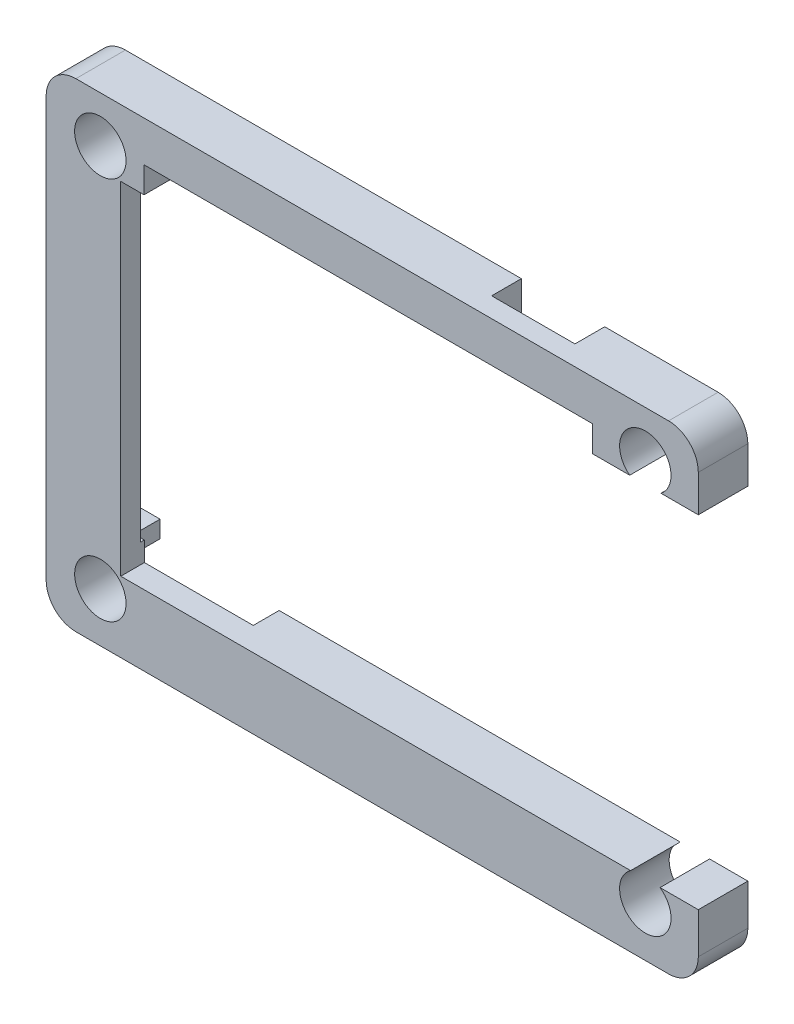
ISO-10303-21;
HEADER;
FILE_DESCRIPTION(('STEP AP214'),'2;1');
FILE_NAME('part.step','',(''),(''),'','','');
FILE_SCHEMA(('AUTOMOTIVE_DESIGN { 1 0 10303 214 1 1 1 1 }'));
ENDSEC;
DATA;
#1=APPLICATION_CONTEXT('core data for automotive mechanical design processes');
#2=APPLICATION_PROTOCOL_DEFINITION('international standard','automotive_design',2000,#1);
#3=PRODUCT_CONTEXT('',#1,'mechanical');
#4=PRODUCT('Part','Part','',(#3));
#5=PRODUCT_RELATED_PRODUCT_CATEGORY('part','',(#4));
#6=PRODUCT_DEFINITION_FORMATION('','',#4);
#7=PRODUCT_DEFINITION_CONTEXT('part definition',#1,'design');
#8=PRODUCT_DEFINITION('design','',#6,#7);
#9=PRODUCT_DEFINITION_SHAPE('','',#8);
#10=(LENGTH_UNIT() NAMED_UNIT(*) SI_UNIT(.MILLI.,.METRE.));
#11=(NAMED_UNIT(*) PLANE_ANGLE_UNIT() SI_UNIT($,.RADIAN.));
#12=(NAMED_UNIT(*) SI_UNIT($,.STERADIAN.) SOLID_ANGLE_UNIT());
#13=UNCERTAINTY_MEASURE_WITH_UNIT(LENGTH_MEASURE(1.E-05),#10,'distance_accuracy_value','');
#14=(GEOMETRIC_REPRESENTATION_CONTEXT(3) GLOBAL_UNCERTAINTY_ASSIGNED_CONTEXT((#13)) GLOBAL_UNIT_ASSIGNED_CONTEXT((#10,
#11,#12)) REPRESENTATION_CONTEXT('',''));
#15=CARTESIAN_POINT('',(0.,0.,0.));
#16=DIRECTION('',(0.,0.,1.));
#17=DIRECTION('',(1.,0.,0.));
#18=AXIS2_PLACEMENT_3D('',#15,#16,#17);
#19=CARTESIAN_POINT('',(-28.525564645271,18.7306273404926,5.));
#20=DIRECTION('',(0.,-1.,0.));
#21=DIRECTION('',(0.,0.,-1.));
#22=AXIS2_PLACEMENT_3D('',#19,#20,#21);
#23=PLANE('',#22);
#24=DIRECTION('',(0.,0.,-1.));
#25=VECTOR('',#24,1.);
#26=CARTESIAN_POINT('',(-26.1750892203821,18.7306273404926,5.));
#27=LINE('',#26,#25);
#28=CARTESIAN_POINT('',(-26.1750892203821,18.7306273404926,5.));
#29=VERTEX_POINT('',#28);
#30=CARTESIAN_POINT('',(-26.1750892203821,18.7306273404926,0.));
#31=VERTEX_POINT('',#30);
#32=EDGE_CURVE('E11',#29,#31,#27,.T.);
#33=ORIENTED_EDGE('',*,*,#32,.F.);
#34=DIRECTION('',(-1.,0.,0.));
#35=VECTOR('',#34,1.);
#36=CARTESIAN_POINT('',(-28.525564645271,18.7306273404926,5.));
#37=LINE('',#36,#35);
#38=CARTESIAN_POINT('',(-28.525564645271,18.7306273404926,5.));
#39=VERTEX_POINT('',#38);
#40=EDGE_CURVE('E389',#29,#39,#37,.T.);
#41=ORIENTED_EDGE('',*,*,#40,.T.);
#42=DIRECTION('',(0.,0.,-1.));
#43=VECTOR('',#42,1.);
#44=CARTESIAN_POINT('',(-28.525564645271,18.7306273404926,5.));
#45=LINE('',#44,#43);
#46=CARTESIAN_POINT('',(-28.525564645271,18.7306273404926,0.));
#47=VERTEX_POINT('',#46);
#48=EDGE_CURVE('E393',#39,#47,#45,.T.);
#49=ORIENTED_EDGE('',*,*,#48,.T.);
#50=DIRECTION('',(-1.,0.,0.));
#51=VECTOR('',#50,1.);
#52=CARTESIAN_POINT('',(-28.525564645271,18.7306273404926,0.));
#53=LINE('',#52,#51);
#54=EDGE_CURVE('E398',#31,#47,#53,.T.);
#55=ORIENTED_EDGE('',*,*,#54,.F.);
#56=EDGE_LOOP('',(#33,#41,#49,#55));
#57=FACE_BOUND('',#56,.T.);
#58=ADVANCED_FACE('F33',(#57),#23,.T.);
#59=CARTESIAN_POINT('',(26.7614293353351,-19.8969849238105,0.));
#60=DIRECTION('',(0.,0.,1.));
#61=DIRECTION('',(1.,0.,0.));
#62=AXIS2_PLACEMENT_3D('',#59,#60,#61);
#63=PLANE('',#62);
#64=CARTESIAN_POINT('',(-30.5853658536585,20.7926829268293,0.));
#65=DIRECTION('',(0.,0.,1.));
#66=DIRECTION('',(1.,0.,0.));
#67=AXIS2_PLACEMENT_3D('',#64,#65,#66);
#68=CIRCLE('',#67,2.59469718365549);
#69=CARTESIAN_POINT('',(-27.990668670003,20.7926829268293,0.));
#70=VERTEX_POINT('',#69);
#71=EDGE_CURVE('E422',#70,#70,#68,.T.);
#72=ORIENTED_EDGE('',*,*,#71,.T.);
#73=EDGE_LOOP('',(#72));
#74=FACE_BOUND('',#73,.T.);
#75=DIRECTION('',(1.,0.,0.));
#76=VECTOR('',#75,1.);
#77=CARTESIAN_POINT('',(-26.1750892203821,21.3558733539494,0.));
#78=LINE('',#77,#76);
#79=CARTESIAN_POINT('',(-26.1750892203821,21.3558733539494,0.));
#80=VERTEX_POINT('',#79);
#81=CARTESIAN_POINT('',(6.90638538472967,21.3558733539494,0.));
#82=VERTEX_POINT('',#81);
#83=EDGE_CURVE('E265',#80,#82,#78,.T.);
#84=ORIENTED_EDGE('',*,*,#83,.F.);
#85=DIRECTION('',(0.,1.,0.));
#86=VECTOR('',#85,1.);
#87=CARTESIAN_POINT('',(-26.1750892203821,17.3349206395159,0.));
#88=LINE('',#87,#86);
#89=EDGE_CURVE('E253',#31,#80,#88,.T.);
#90=ORIENTED_EDGE('',*,*,#89,.F.);
#91=ORIENTED_EDGE('',*,*,#54,.T.);
#92=DIRECTION('',(0.,-1.,0.));
#93=VECTOR('',#92,1.);
#94=CARTESIAN_POINT('',(-28.525564645271,18.7306273404926,0.));
#95=LINE('',#94,#93);
#96=CARTESIAN_POINT('',(-28.525564645271,17.1803721583385,0.));
#97=VERTEX_POINT('',#96);
#98=EDGE_CURVE('E383',#47,#97,#95,.T.);
#99=ORIENTED_EDGE('',*,*,#98,.T.);
#100=DIRECTION('',(1.,0.,0.));
#101=VECTOR('',#100,1.);
#102=CARTESIAN_POINT('',(-36.0534221380431,17.1803721583385,0.));
#103=LINE('',#102,#101);
#104=CARTESIAN_POINT('',(-36.0534221380431,17.1803721583385,0.));
#105=VERTEX_POINT('',#104);
#106=EDGE_CURVE('E332',#105,#97,#103,.T.);
#107=ORIENTED_EDGE('',*,*,#106,.F.);
#108=DIRECTION('',(0.,-1.,0.));
#109=VECTOR('',#108,1.);
#110=CARTESIAN_POINT('',(-36.0534221380431,22.4448971318567,0.));
#111=LINE('',#110,#109);
#112=CARTESIAN_POINT('',(-36.0534221380431,22.4448971318567,0.));
#113=VERTEX_POINT('',#112);
#114=EDGE_CURVE('E467',#113,#105,#111,.T.);
#115=ORIENTED_EDGE('',*,*,#114,.F.);
#116=CARTESIAN_POINT('',(-33.0534221380431,22.4448971318567,0.));
#117=DIRECTION('',(0.,0.,1.));
#118=DIRECTION('',(1.,0.,0.));
#119=AXIS2_PLACEMENT_3D('',#116,#117,#118);
#120=CIRCLE('',#119,3.);
#121=CARTESIAN_POINT('',(-33.0534221380431,25.4448971318567,0.));
#122=VERTEX_POINT('',#121);
#123=EDGE_CURVE('E464',#122,#113,#120,.T.);
#124=ORIENTED_EDGE('',*,*,#123,.F.);
#125=DIRECTION('',(-1.,0.,0.));
#126=VECTOR('',#125,1.);
#127=CARTESIAN_POINT('',(-33.0534221380431,25.4448971318567,0.));
#128=LINE('',#127,#126);
#129=CARTESIAN_POINT('',(6.90638538472967,25.4448971318567,0.));
#130=VERTEX_POINT('',#129);
#131=EDGE_CURVE('E460',#130,#122,#128,.T.);
#132=ORIENTED_EDGE('',*,*,#131,.F.);
#133=DIRECTION('',(0.,1.,0.));
#134=VECTOR('',#133,1.);
#135=CARTESIAN_POINT('',(6.90638538472967,13.67950908094,0.));
#136=LINE('',#135,#134);
#137=EDGE_CURVE('E275',#82,#130,#136,.T.);
#138=ORIENTED_EDGE('',*,*,#137,.F.);
#139=EDGE_LOOP('',(#84,#90,#91,#99,#107,#115,#124,#132,#138));
#140=FACE_BOUND('',#139,.T.);
#141=ADVANCED_FACE('F273',(#74,#140),#63,.F.);
#142=CARTESIAN_POINT('',(22.8397118518369,18.7306273404926,0.));
#143=VERTEX_POINT('',#142);
#144=CARTESIAN_POINT('',(19.0606288169945,18.7306273404926,0.));
#145=VERTEX_POINT('',#144);
#146=EDGE_CURVE('E387',#143,#145,#53,.T.);
#147=ORIENTED_EDGE('',*,*,#146,.T.);
#148=DIRECTION('',(0.,-1.,0.));
#149=VECTOR('',#148,1.);
#150=CARTESIAN_POINT('',(19.0606288169945,17.3349206395159,0.));
#151=LINE('',#150,#149);
#152=CARTESIAN_POINT('',(19.0606288169945,21.3558733539494,0.));
#153=VERTEX_POINT('',#152);
#154=EDGE_CURVE('E270',#153,#145,#151,.T.);
#155=ORIENTED_EDGE('',*,*,#154,.F.);
#156=CARTESIAN_POINT('',(15.3138319694542,21.3558733539494,0.));
#157=VERTEX_POINT('',#156);
#158=EDGE_CURVE('E262',#157,#153,#78,.T.);
#159=ORIENTED_EDGE('',*,*,#158,.F.);
#160=DIRECTION('',(0.,-1.,0.));
#161=VECTOR('',#160,1.);
#162=CARTESIAN_POINT('',(15.3138319694542,13.67950908094,0.));
#163=LINE('',#162,#161);
#164=CARTESIAN_POINT('',(15.3138319694542,25.4448971318567,0.));
#165=VERTEX_POINT('',#164);
#166=EDGE_CURVE('E293',#165,#157,#163,.T.);
#167=ORIENTED_EDGE('',*,*,#166,.F.);
#168=CARTESIAN_POINT('',(26.7614293353351,25.4448971318567,0.));
#169=VERTEX_POINT('',#168);
#170=EDGE_CURVE('E461',#169,#165,#128,.T.);
#171=ORIENTED_EDGE('',*,*,#170,.F.);
#172=CARTESIAN_POINT('',(26.7614293353351,22.4448971318567,0.));
#173=DIRECTION('',(0.,0.,1.));
#174=DIRECTION('',(-1.,0.,0.));
#175=AXIS2_PLACEMENT_3D('',#172,#173,#174);
#176=CIRCLE('',#175,3.);
#177=CARTESIAN_POINT('',(29.7614293353351,22.4448971318567,0.));
#178=VERTEX_POINT('',#177);
#179=EDGE_CURVE('E458',#178,#169,#176,.T.);
#180=ORIENTED_EDGE('',*,*,#179,.F.);
#181=DIRECTION('',(0.,1.,0.));
#182=VECTOR('',#181,1.);
#183=CARTESIAN_POINT('',(29.7614293353351,22.4448971318567,0.));
#184=LINE('',#183,#182);
#185=CARTESIAN_POINT('',(29.7614293353351,18.7306273404926,0.));
#186=VERTEX_POINT('',#185);
#187=EDGE_CURVE('E454',#186,#178,#184,.T.);
#188=ORIENTED_EDGE('',*,*,#187,.F.);
#189=DIRECTION('',(-1.,0.,0.));
#190=VECTOR('',#189,1.);
#191=CARTESIAN_POINT('',(26.7614293353351,18.7306273404926,0.));
#192=LINE('',#191,#190);
#193=CARTESIAN_POINT('',(25.989556440846,18.7306273404926,0.));
#194=VERTEX_POINT('',#193);
#195=EDGE_CURVE('E325',#186,#194,#192,.T.);
#196=ORIENTED_EDGE('',*,*,#195,.T.);
#197=CARTESIAN_POINT('',(24.4146341463415,20.7926829268293,0.));
#198=DIRECTION('',(0.,0.,1.));
#199=DIRECTION('',(1.,0.,0.));
#200=AXIS2_PLACEMENT_3D('',#197,#198,#199);
#201=CIRCLE('',#200,2.59469718365549);
#202=EDGE_CURVE('E416',#194,#143,#201,.T.);
#203=ORIENTED_EDGE('',*,*,#202,.T.);
#204=EDGE_LOOP('',(#147,#155,#159,#167,#171,#180,#188,#196,#203));
#205=FACE_BOUND('',#204,.T.);
#206=ADVANCED_FACE('F644',(#205),#63,.F.);
#207=CARTESIAN_POINT('',(29.7614293353351,22.4448971318567,5.));
#208=DIRECTION('',(-1.,0.,0.));
#209=DIRECTION('',(0.,-1.,0.));
#210=AXIS2_PLACEMENT_3D('',#207,#208,#209);
#211=PLANE('',#210);
#212=DIRECTION('',(0.,1.,0.));
#213=VECTOR('',#212,1.);
#214=CARTESIAN_POINT('',(29.7614293353351,22.4448971318567,5.));
#215=LINE('',#214,#213);
#216=CARTESIAN_POINT('',(29.7614293353351,18.7306273404926,5.));
#217=VERTEX_POINT('',#216);
#218=CARTESIAN_POINT('',(29.7614293353351,22.4448971318567,5.));
#219=VERTEX_POINT('',#218);
#220=EDGE_CURVE('E434',#217,#219,#215,.T.);
#221=ORIENTED_EDGE('',*,*,#220,.F.);
#222=DIRECTION('',(0.,0.,-1.));
#223=VECTOR('',#222,1.);
#224=CARTESIAN_POINT('',(29.7614293353351,18.7306273404926,5.));
#225=LINE('',#224,#223);
#226=EDGE_CURVE('E328',#217,#186,#225,.T.);
#227=ORIENTED_EDGE('',*,*,#226,.T.);
#228=ORIENTED_EDGE('',*,*,#187,.T.);
#229=DIRECTION('',(0.,0.,-1.));
#230=VECTOR('',#229,1.);
#231=CARTESIAN_POINT('',(29.7614293353351,22.4448971318567,5.));
#232=LINE('',#231,#230);
#233=EDGE_CURVE('E492',#219,#178,#232,.T.);
#234=ORIENTED_EDGE('',*,*,#233,.F.);
#235=EDGE_LOOP('',(#221,#227,#228,#234));
#236=FACE_BOUND('',#235,.T.);
#237=ADVANCED_FACE('F530',(#236),#211,.F.);
#238=CARTESIAN_POINT('',(-36.0534221380431,-13.8046167355697,0.));
#239=VERTEX_POINT('',#238);
#240=CARTESIAN_POINT('',(-36.0534221380431,-19.8969849238105,0.));
#241=VERTEX_POINT('',#240);
#242=EDGE_CURVE('E466',#239,#241,#111,.T.);
#243=ORIENTED_EDGE('',*,*,#242,.F.);
#244=DIRECTION('',(-1.,0.,0.));
#245=VECTOR('',#244,1.);
#246=CARTESIAN_POINT('',(-36.0534221380431,-13.8046167355697,0.));
#247=LINE('',#246,#245);
#248=CARTESIAN_POINT('',(-29.5563449120647,-13.8046167355697,0.));
#249=VERTEX_POINT('',#248);
#250=EDGE_CURVE('E337',#249,#239,#247,.T.);
#251=ORIENTED_EDGE('',*,*,#250,.F.);
#252=DIRECTION('',(0.,-1.,0.));
#253=VECTOR('',#252,1.);
#254=CARTESIAN_POINT('',(-29.5563449120647,-12.8969849238105,0.));
#255=LINE('',#254,#253);
#256=CARTESIAN_POINT('',(-29.5563449120647,-15.5253915124886,0.));
#257=VERTEX_POINT('',#256);
#258=EDGE_CURVE('E377',#249,#257,#255,.T.);
#259=ORIENTED_EDGE('',*,*,#258,.T.);
#260=CARTESIAN_POINT('',(-30.5853658536585,-17.9073170731707,0.));
#261=DIRECTION('',(0.,0.,1.));
#262=DIRECTION('',(1.,0.,0.));
#263=AXIS2_PLACEMENT_3D('',#260,#261,#262);
#264=CIRCLE('',#263,2.59469718365549);
#265=CARTESIAN_POINT('',(-29.5563449120647,-20.2892426338529,0.));
#266=VERTEX_POINT('',#265);
#267=EDGE_CURVE('E410',#257,#266,#264,.T.);
#268=ORIENTED_EDGE('',*,*,#267,.T.);
#269=CARTESIAN_POINT('',(-29.5563449120647,-22.8969849238105,0.));
#270=VERTEX_POINT('',#269);
#271=EDGE_CURVE('E368',#266,#270,#255,.T.);
#272=ORIENTED_EDGE('',*,*,#271,.T.);
#273=DIRECTION('',(1.,0.,0.));
#274=VECTOR('',#273,1.);
#275=CARTESIAN_POINT('',(-33.0534221380431,-22.8969849238105,0.));
#276=LINE('',#275,#274);
#277=CARTESIAN_POINT('',(-33.0534221380431,-22.8969849238105,0.));
#278=VERTEX_POINT('',#277);
#279=EDGE_CURVE('E435',#278,#270,#276,.T.);
#280=ORIENTED_EDGE('',*,*,#279,.F.);
#281=CARTESIAN_POINT('',(-33.0534221380431,-19.8969849238105,0.));
#282=DIRECTION('',(0.,0.,1.));
#283=DIRECTION('',(1.,0.,0.));
#284=AXIS2_PLACEMENT_3D('',#281,#282,#283);
#285=CIRCLE('',#284,3.);
#286=EDGE_CURVE('E470',#241,#278,#285,.T.);
#287=ORIENTED_EDGE('',*,*,#286,.F.);
#288=EDGE_LOOP('',(#243,#251,#259,#268,#272,#280,#287));
#289=FACE_BOUND('',#288,.T.);
#290=ADVANCED_FACE('F612',(#289),#63,.F.);
#291=CARTESIAN_POINT('',(26.7614293353351,-19.8969849238105,5.));
#292=DIRECTION('',(0.,0.,1.));
#293=DIRECTION('',(1.,0.,0.));
#294=AXIS2_PLACEMENT_3D('',#291,#292,#293);
#295=PLANE('',#294);
#296=DIRECTION('',(0.,-1.,0.));
#297=VECTOR('',#296,1.);
#298=CARTESIAN_POINT('',(-26.1750892203821,-19.8969849238105,5.));
#299=LINE('',#298,#297);
#300=CARTESIAN_POINT('',(-26.1750892203821,21.3558733539494,5.));
#301=VERTEX_POINT('',#300);
#302=EDGE_CURVE('E288',#301,#29,#299,.T.);
#303=ORIENTED_EDGE('',*,*,#302,.F.);
#304=DIRECTION('',(-1.,0.,0.));
#305=VECTOR('',#304,1.);
#306=CARTESIAN_POINT('',(26.7614293353351,21.3558733539494,5.));
#307=LINE('',#306,#305);
#308=CARTESIAN_POINT('',(19.0606288169945,21.3558733539494,5.));
#309=VERTEX_POINT('',#308);
#310=EDGE_CURVE('E268',#309,#301,#307,.T.);
#311=ORIENTED_EDGE('',*,*,#310,.F.);
#312=DIRECTION('',(0.,1.,0.));
#313=VECTOR('',#312,1.);
#314=CARTESIAN_POINT('',(19.0606288169945,-19.8969849238105,5.));
#315=LINE('',#314,#313);
#316=CARTESIAN_POINT('',(19.0606288169945,18.7306273404926,5.));
#317=VERTEX_POINT('',#316);
#318=EDGE_CURVE('E286',#317,#309,#315,.T.);
#319=ORIENTED_EDGE('',*,*,#318,.F.);
#320=CARTESIAN_POINT('',(22.8397118518369,18.7306273404926,5.));
#321=VERTEX_POINT('',#320);
#322=EDGE_CURVE('E390',#321,#317,#37,.T.);
#323=ORIENTED_EDGE('',*,*,#322,.F.);
#324=CARTESIAN_POINT('',(24.4146341463415,20.7926829268293,5.));
#325=DIRECTION('',(0.,0.,1.));
#326=DIRECTION('',(1.,0.,0.));
#327=AXIS2_PLACEMENT_3D('',#324,#325,#326);
#328=CIRCLE('',#327,2.59469718365549);
#329=CARTESIAN_POINT('',(25.989556440846,18.7306273404926,5.));
#330=VERTEX_POINT('',#329);
#331=EDGE_CURVE('E419',#330,#321,#328,.T.);
#332=ORIENTED_EDGE('',*,*,#331,.F.);
#333=DIRECTION('',(-1.,0.,0.));
#334=VECTOR('',#333,1.);
#335=CARTESIAN_POINT('',(22.2295288463831,18.7306273404926,5.));
#336=LINE('',#335,#334);
#337=EDGE_CURVE('E56',#217,#330,#336,.T.);
#338=ORIENTED_EDGE('',*,*,#337,.F.);
#339=ORIENTED_EDGE('',*,*,#220,.T.);
#340=CARTESIAN_POINT('',(26.7614293353351,22.4448971318567,5.));
#341=DIRECTION('',(0.,0.,1.));
#342=DIRECTION('',(-1.,0.,0.));
#343=AXIS2_PLACEMENT_3D('',#340,#341,#342);
#344=CIRCLE('',#343,3.);
#345=CARTESIAN_POINT('',(26.7614293353351,25.4448971318567,5.));
#346=VERTEX_POINT('',#345);
#347=EDGE_CURVE('E439',#219,#346,#344,.T.);
#348=ORIENTED_EDGE('',*,*,#347,.T.);
#349=DIRECTION('',(-1.,0.,0.));
#350=VECTOR('',#349,1.);
#351=CARTESIAN_POINT('',(-33.0534221380431,25.4448971318567,5.));
#352=LINE('',#351,#350);
#353=CARTESIAN_POINT('',(-33.0534221380431,25.4448971318567,5.));
#354=VERTEX_POINT('',#353);
#355=EDGE_CURVE('E441',#346,#354,#352,.T.);
#356=ORIENTED_EDGE('',*,*,#355,.T.);
#357=CARTESIAN_POINT('',(-33.0534221380431,22.4448971318567,5.));
#358=DIRECTION('',(0.,0.,1.));
#359=DIRECTION('',(1.,0.,0.));
#360=AXIS2_PLACEMENT_3D('',#357,#358,#359);
#361=CIRCLE('',#360,3.);
#362=CARTESIAN_POINT('',(-36.0534221380431,22.4448971318567,5.));
#363=VERTEX_POINT('',#362);
#364=EDGE_CURVE('E443',#354,#363,#361,.T.);
#365=ORIENTED_EDGE('',*,*,#364,.T.);
#366=DIRECTION('',(0.,-1.,0.));
#367=VECTOR('',#366,1.);
#368=CARTESIAN_POINT('',(-36.0534221380431,22.4448971318567,5.));
#369=LINE('',#368,#367);
#370=CARTESIAN_POINT('',(-36.0534221380431,-19.8969849238105,5.));
#371=VERTEX_POINT('',#370);
#372=EDGE_CURVE('E445',#363,#371,#369,.T.);
#373=ORIENTED_EDGE('',*,*,#372,.T.);
#374=CARTESIAN_POINT('',(-33.0534221380431,-19.8969849238105,5.));
#375=DIRECTION('',(0.,0.,1.));
#376=DIRECTION('',(1.,0.,0.));
#377=AXIS2_PLACEMENT_3D('',#374,#375,#376);
#378=CIRCLE('',#377,3.);
#379=CARTESIAN_POINT('',(-33.0534221380431,-22.8969849238105,5.));
#380=VERTEX_POINT('',#379);
#381=EDGE_CURVE('E447',#371,#380,#378,.T.);
#382=ORIENTED_EDGE('',*,*,#381,.T.);
#383=DIRECTION('',(1.,0.,0.));
#384=VECTOR('',#383,1.);
#385=CARTESIAN_POINT('',(-33.0534221380431,-22.8969849238105,5.));
#386=LINE('',#385,#384);
#387=CARTESIAN_POINT('',(26.7614293353351,-22.8969849238105,5.));
#388=VERTEX_POINT('',#387);
#389=EDGE_CURVE('E449',#380,#388,#386,.T.);
#390=ORIENTED_EDGE('',*,*,#389,.T.);
#391=CARTESIAN_POINT('',(26.7614293353351,-19.8969849238105,5.));
#392=DIRECTION('',(0.,0.,1.));
#393=DIRECTION('',(1.,0.,0.));
#394=AXIS2_PLACEMENT_3D('',#391,#392,#393);
#395=CIRCLE('',#394,3.);
#396=CARTESIAN_POINT('',(29.7614293353351,-19.8969849238105,5.));
#397=VERTEX_POINT('',#396);
#398=EDGE_CURVE('E431',#388,#397,#395,.T.);
#399=ORIENTED_EDGE('',*,*,#398,.T.);
#400=CARTESIAN_POINT('',(29.7614293353351,-15.7784872594867,5.));
#401=VERTEX_POINT('',#400);
#402=EDGE_CURVE('E436',#397,#401,#215,.T.);
#403=ORIENTED_EDGE('',*,*,#402,.T.);
#404=DIRECTION('',(1.,0.,0.));
#405=VECTOR('',#404,1.);
#406=CARTESIAN_POINT('',(22.2295288463831,-15.7784872594867,5.));
#407=LINE('',#406,#405);
#408=CARTESIAN_POINT('',(25.8980548888281,-15.7784872594867,5.));
#409=VERTEX_POINT('',#408);
#410=EDGE_CURVE('E307',#409,#401,#407,.T.);
#411=ORIENTED_EDGE('',*,*,#410,.F.);
#412=CARTESIAN_POINT('',(24.4146341463415,-17.9073170731707,5.));
#413=DIRECTION('',(0.,0.,1.));
#414=DIRECTION('',(1.,0.,0.));
#415=AXIS2_PLACEMENT_3D('',#412,#413,#414);
#416=CIRCLE('',#415,2.59469718365549);
#417=CARTESIAN_POINT('',(22.9312134038548,-15.7784872594867,5.));
#418=VERTEX_POINT('',#417);
#419=EDGE_CURVE('E407',#418,#409,#416,.T.);
#420=ORIENTED_EDGE('',*,*,#419,.F.);
#421=DIRECTION('',(1.,0.,0.));
#422=VECTOR('',#421,1.);
#423=CARTESIAN_POINT('',(-28.525564645271,-15.7784872594867,5.));
#424=LINE('',#423,#422);
#425=CARTESIAN_POINT('',(-28.525564645271,-15.7784872594867,5.));
#426=VERTEX_POINT('',#425);
#427=EDGE_CURVE('E386',#426,#418,#424,.T.);
#428=ORIENTED_EDGE('',*,*,#427,.F.);
#429=DIRECTION('',(0.,-1.,0.));
#430=VECTOR('',#429,1.);
#431=CARTESIAN_POINT('',(-28.525564645271,18.7306273404926,5.));
#432=LINE('',#431,#430);
#433=EDGE_CURVE('E384',#39,#426,#432,.T.);
#434=ORIENTED_EDGE('',*,*,#433,.F.);
#435=ORIENTED_EDGE('',*,*,#40,.F.);
#436=EDGE_LOOP('',(#303,#311,#319,#323,#332,#338,#339,#348,#356,#365,#373,#382,#390,#399,#403,
#411,#420,#428,#434,#435));
#437=FACE_BOUND('',#436,.T.);
#438=CARTESIAN_POINT('',(-30.5853658536585,-17.9073170731707,5.));
#439=DIRECTION('',(0.,0.,1.));
#440=DIRECTION('',(1.,0.,0.));
#441=AXIS2_PLACEMENT_3D('',#438,#439,#440);
#442=CIRCLE('',#441,2.59469718365549);
#443=CARTESIAN_POINT('',(-27.990668670003,-17.9073170731707,5.));
#444=VERTEX_POINT('',#443);
#445=EDGE_CURVE('E413',#444,#444,#442,.T.);
#446=ORIENTED_EDGE('',*,*,#445,.F.);
#447=EDGE_LOOP('',(#446));
#448=FACE_BOUND('',#447,.T.);
#449=CARTESIAN_POINT('',(-30.5853658536585,20.7926829268293,5.));
#450=DIRECTION('',(0.,0.,1.));
#451=DIRECTION('',(1.,0.,0.));
#452=AXIS2_PLACEMENT_3D('',#449,#450,#451);
#453=CIRCLE('',#452,2.59469718365549);
#454=CARTESIAN_POINT('',(-27.990668670003,20.7926829268293,5.));
#455=VERTEX_POINT('',#454);
#456=EDGE_CURVE('E425',#455,#455,#453,.T.);
#457=ORIENTED_EDGE('',*,*,#456,.F.);
#458=EDGE_LOOP('',(#457));
#459=FACE_BOUND('',#458,.T.);
#460=ADVANCED_FACE('F519',(#437,#448,#459),#295,.T.);
#461=DIRECTION('',(1.,0.,0.));
#462=VECTOR('',#461,1.);
#463=CARTESIAN_POINT('',(-28.525564645271,-15.7784872594867,0.));
#464=LINE('',#463,#462);
#465=CARTESIAN_POINT('',(-17.5391794132465,-15.7784872594867,0.));
#466=VERTEX_POINT('',#465);
#467=CARTESIAN_POINT('',(22.9312134038548,-15.7784872594867,0.));
#468=VERTEX_POINT('',#467);
#469=EDGE_CURVE('E396',#466,#468,#464,.T.);
#470=ORIENTED_EDGE('',*,*,#469,.T.);
#471=CARTESIAN_POINT('',(24.4146341463415,-17.9073170731707,0.));
#472=DIRECTION('',(0.,0.,1.));
#473=DIRECTION('',(1.,0.,0.));
#474=AXIS2_PLACEMENT_3D('',#471,#472,#473);
#475=CIRCLE('',#474,2.59469718365549);
#476=CARTESIAN_POINT('',(25.8980548888281,-15.7784872594867,0.));
#477=VERTEX_POINT('',#476);
#478=EDGE_CURVE('E406',#468,#477,#475,.T.);
#479=ORIENTED_EDGE('',*,*,#478,.T.);
#480=DIRECTION('',(1.,0.,0.));
#481=VECTOR('',#480,1.);
#482=CARTESIAN_POINT('',(26.7614293353351,-15.7784872594867,0.));
#483=LINE('',#482,#481);
#484=CARTESIAN_POINT('',(29.7614293353351,-15.7784872594867,0.));
#485=VERTEX_POINT('',#484);
#486=EDGE_CURVE('E312',#477,#485,#483,.T.);
#487=ORIENTED_EDGE('',*,*,#486,.T.);
#488=CARTESIAN_POINT('',(29.7614293353351,-19.8969849238105,0.));
#489=VERTEX_POINT('',#488);
#490=EDGE_CURVE('E455',#489,#485,#184,.T.);
#491=ORIENTED_EDGE('',*,*,#490,.F.);
#492=CARTESIAN_POINT('',(26.7614293353351,-19.8969849238105,0.));
#493=DIRECTION('',(0.,0.,1.));
#494=DIRECTION('',(1.,0.,0.));
#495=AXIS2_PLACEMENT_3D('',#492,#493,#494);
#496=CIRCLE('',#495,3.);
#497=CARTESIAN_POINT('',(26.7614293353351,-22.8969849238105,0.));
#498=VERTEX_POINT('',#497);
#499=EDGE_CURVE('E428',#498,#489,#496,.T.);
#500=ORIENTED_EDGE('',*,*,#499,.F.);
#501=CARTESIAN_POINT('',(-17.5391794132465,-22.8969849238105,0.));
#502=VERTEX_POINT('',#501);
#503=EDGE_CURVE('E472',#502,#498,#276,.T.);
#504=ORIENTED_EDGE('',*,*,#503,.F.);
#505=DIRECTION('',(0.,-1.,0.));
#506=VECTOR('',#505,1.);
#507=CARTESIAN_POINT('',(-17.5391794132465,-12.8969849238105,0.));
#508=LINE('',#507,#506);
#509=EDGE_CURVE('E375',#466,#502,#508,.T.);
#510=ORIENTED_EDGE('',*,*,#509,.F.);
#511=EDGE_LOOP('',(#470,#479,#487,#491,#500,#504,#510));
#512=FACE_BOUND('',#511,.T.);
#513=ADVANCED_FACE('F577',(#512),#63,.F.);
#514=CARTESIAN_POINT('',(26.7614293353351,-19.8969849238105,5.));
#515=DIRECTION('',(0.,0.,-1.));
#516=DIRECTION('',(-1.,0.,0.));
#517=AXIS2_PLACEMENT_3D('',#514,#515,#516);
#518=CYLINDRICAL_SURFACE('',#517,3.);
#519=ORIENTED_EDGE('',*,*,#499,.T.);
#520=DIRECTION('',(0.,0.,-1.));
#521=VECTOR('',#520,1.);
#522=CARTESIAN_POINT('',(29.7614293353351,-19.8969849238105,5.));
#523=LINE('',#522,#521);
#524=EDGE_CURVE('E495',#397,#489,#523,.T.);
#525=ORIENTED_EDGE('',*,*,#524,.F.);
#526=ORIENTED_EDGE('',*,*,#398,.F.);
#527=DIRECTION('',(0.,0.,-1.));
#528=VECTOR('',#527,1.);
#529=CARTESIAN_POINT('',(26.7614293353351,-22.8969849238105,5.));
#530=LINE('',#529,#528);
#531=EDGE_CURVE('E451',#388,#498,#530,.T.);
#532=ORIENTED_EDGE('',*,*,#531,.T.);
#533=EDGE_LOOP('',(#519,#525,#526,#532));
#534=FACE_BOUND('',#533,.T.);
#535=ADVANCED_FACE('F35',(#534),#518,.T.);
#536=ORIENTED_EDGE('',*,*,#490,.T.);
#537=DIRECTION('',(0.,0.,1.));
#538=VECTOR('',#537,1.);
#539=CARTESIAN_POINT('',(29.7614293353351,-15.7784872594867,5.));
#540=LINE('',#539,#538);
#541=EDGE_CURVE('E315',#485,#401,#540,.T.);
#542=ORIENTED_EDGE('',*,*,#541,.T.);
#543=ORIENTED_EDGE('',*,*,#402,.F.);
#544=ORIENTED_EDGE('',*,*,#524,.T.);
#545=EDGE_LOOP('',(#536,#542,#543,#544));
#546=FACE_BOUND('',#545,.T.);
#547=ADVANCED_FACE('F572',(#546),#211,.F.);
#548=CARTESIAN_POINT('',(26.7614293353351,22.4448971318567,5.));
#549=DIRECTION('',(0.,0.,-1.));
#550=DIRECTION('',(-1.,0.,0.));
#551=AXIS2_PLACEMENT_3D('',#548,#549,#550);
#552=CYLINDRICAL_SURFACE('',#551,3.);
#553=ORIENTED_EDGE('',*,*,#179,.T.);
#554=DIRECTION('',(0.,0.,-1.));
#555=VECTOR('',#554,1.);
#556=CARTESIAN_POINT('',(26.7614293353351,25.4448971318567,5.));
#557=LINE('',#556,#555);
#558=EDGE_CURVE('E489',#346,#169,#557,.T.);
#559=ORIENTED_EDGE('',*,*,#558,.F.);
#560=ORIENTED_EDGE('',*,*,#347,.F.);
#561=ORIENTED_EDGE('',*,*,#233,.T.);
#562=EDGE_LOOP('',(#553,#559,#560,#561));
#563=FACE_BOUND('',#562,.T.);
#564=ADVANCED_FACE('F536',(#563),#552,.T.);
#565=CARTESIAN_POINT('',(-33.0534221380431,25.4448971318567,5.));
#566=DIRECTION('',(0.,-1.,0.));
#567=DIRECTION('',(0.,0.,-1.));
#568=AXIS2_PLACEMENT_3D('',#565,#566,#567);
#569=PLANE('',#568);
#570=DIRECTION('',(1.,0.,0.));
#571=VECTOR('',#570,1.);
#572=CARTESIAN_POINT('',(-33.0534221380431,25.4448971318567,3.));
#573=LINE('',#572,#571);
#574=CARTESIAN_POINT('',(6.90638538472967,25.4448971318567,3.));
#575=VERTEX_POINT('',#574);
#576=CARTESIAN_POINT('',(15.3138319694542,25.4448971318567,3.));
#577=VERTEX_POINT('',#576);
#578=EDGE_CURVE('E296',#575,#577,#573,.T.);
#579=ORIENTED_EDGE('',*,*,#578,.F.);
#580=DIRECTION('',(0.,0.,-1.));
#581=VECTOR('',#580,1.);
#582=CARTESIAN_POINT('',(6.90638538472967,25.4448971318567,5.));
#583=LINE('',#582,#581);
#584=EDGE_CURVE('E304',#575,#130,#583,.T.);
#585=ORIENTED_EDGE('',*,*,#584,.T.);
#586=ORIENTED_EDGE('',*,*,#131,.T.);
#587=DIRECTION('',(0.,0.,-1.));
#588=VECTOR('',#587,1.);
#589=CARTESIAN_POINT('',(-33.0534221380431,25.4448971318567,5.));
#590=LINE('',#589,#588);
#591=EDGE_CURVE('E486',#354,#122,#590,.T.);
#592=ORIENTED_EDGE('',*,*,#591,.F.);
#593=ORIENTED_EDGE('',*,*,#355,.F.);
#594=ORIENTED_EDGE('',*,*,#558,.T.);
#595=ORIENTED_EDGE('',*,*,#170,.T.);
#596=DIRECTION('',(0.,0.,1.));
#597=VECTOR('',#596,1.);
#598=CARTESIAN_POINT('',(15.3138319694542,25.4448971318567,5.));
#599=LINE('',#598,#597);
#600=EDGE_CURVE('E301',#165,#577,#599,.T.);
#601=ORIENTED_EDGE('',*,*,#600,.T.);
#602=EDGE_LOOP('',(#579,#585,#586,#592,#593,#594,#595,#601));
#603=FACE_BOUND('',#602,.T.);
#604=ADVANCED_FACE('F543',(#603),#569,.F.);
#605=CARTESIAN_POINT('',(-33.0534221380431,22.4448971318567,5.));
#606=DIRECTION('',(0.,0.,-1.));
#607=DIRECTION('',(-1.,0.,0.));
#608=AXIS2_PLACEMENT_3D('',#605,#606,#607);
#609=CYLINDRICAL_SURFACE('',#608,3.);
#610=ORIENTED_EDGE('',*,*,#123,.T.);
#611=DIRECTION('',(0.,0.,-1.));
#612=VECTOR('',#611,1.);
#613=CARTESIAN_POINT('',(-36.0534221380431,22.4448971318567,5.));
#614=LINE('',#613,#612);
#615=EDGE_CURVE('E483',#363,#113,#614,.T.);
#616=ORIENTED_EDGE('',*,*,#615,.F.);
#617=ORIENTED_EDGE('',*,*,#364,.F.);
#618=ORIENTED_EDGE('',*,*,#591,.T.);
#619=EDGE_LOOP('',(#610,#616,#617,#618));
#620=FACE_BOUND('',#619,.T.);
#621=ADVANCED_FACE('F546',(#620),#609,.T.);
#622=CARTESIAN_POINT('',(-36.0534221380431,22.4448971318567,5.));
#623=DIRECTION('',(1.,0.,0.));
#624=DIRECTION('',(0.,1.,0.));
#625=AXIS2_PLACEMENT_3D('',#622,#623,#624);
#626=PLANE('',#625);
#627=DIRECTION('',(0.,1.,0.));
#628=VECTOR('',#627,1.);
#629=CARTESIAN_POINT('',(-36.0534221380431,17.1803721583385,3.));
#630=LINE('',#629,#628);
#631=CARTESIAN_POINT('',(-36.0534221380431,-13.8046167355697,3.));
#632=VERTEX_POINT('',#631);
#633=CARTESIAN_POINT('',(-36.0534221380431,17.1803721583385,3.));
#634=VERTEX_POINT('',#633);
#635=EDGE_CURVE('E333',#632,#634,#630,.T.);
#636=ORIENTED_EDGE('',*,*,#635,.F.);
#637=DIRECTION('',(0.,0.,-1.));
#638=VECTOR('',#637,1.);
#639=CARTESIAN_POINT('',(-36.0534221380431,-13.8046167355697,3.));
#640=LINE('',#639,#638);
#641=EDGE_CURVE('E348',#632,#239,#640,.T.);
#642=ORIENTED_EDGE('',*,*,#641,.T.);
#643=ORIENTED_EDGE('',*,*,#242,.T.);
#644=DIRECTION('',(0.,0.,-1.));
#645=VECTOR('',#644,1.);
#646=CARTESIAN_POINT('',(-36.0534221380431,-19.8969849238105,5.));
#647=LINE('',#646,#645);
#648=EDGE_CURVE('E480',#371,#241,#647,.T.);
#649=ORIENTED_EDGE('',*,*,#648,.F.);
#650=ORIENTED_EDGE('',*,*,#372,.F.);
#651=ORIENTED_EDGE('',*,*,#615,.T.);
#652=ORIENTED_EDGE('',*,*,#114,.T.);
#653=DIRECTION('',(0.,0.,-1.));
#654=VECTOR('',#653,1.);
#655=CARTESIAN_POINT('',(-36.0534221380431,17.1803721583385,3.));
#656=LINE('',#655,#654);
#657=EDGE_CURVE('E345',#634,#105,#656,.T.);
#658=ORIENTED_EDGE('',*,*,#657,.F.);
#659=EDGE_LOOP('',(#636,#642,#643,#649,#650,#651,#652,#658));
#660=FACE_BOUND('',#659,.T.);
#661=ADVANCED_FACE('F552',(#660),#626,.F.);
#662=CARTESIAN_POINT('',(-33.0534221380431,-19.8969849238105,5.));
#663=DIRECTION('',(0.,0.,-1.));
#664=DIRECTION('',(-1.,0.,0.));
#665=AXIS2_PLACEMENT_3D('',#662,#663,#664);
#666=CYLINDRICAL_SURFACE('',#665,3.);
#667=ORIENTED_EDGE('',*,*,#286,.T.);
#668=DIRECTION('',(0.,0.,-1.));
#669=VECTOR('',#668,1.);
#670=CARTESIAN_POINT('',(-33.0534221380431,-22.8969849238105,5.));
#671=LINE('',#670,#669);
#672=EDGE_CURVE('E477',#380,#278,#671,.T.);
#673=ORIENTED_EDGE('',*,*,#672,.F.);
#674=ORIENTED_EDGE('',*,*,#381,.F.);
#675=ORIENTED_EDGE('',*,*,#648,.T.);
#676=EDGE_LOOP('',(#667,#673,#674,#675));
#677=FACE_BOUND('',#676,.T.);
#678=ADVANCED_FACE('F558',(#677),#666,.T.);
#679=CARTESIAN_POINT('',(-33.0534221380431,-22.8969849238105,5.));
#680=DIRECTION('',(0.,1.,0.));
#681=DIRECTION('',(0.,0.,1.));
#682=AXIS2_PLACEMENT_3D('',#679,#680,#681);
#683=PLANE('',#682);
#684=ORIENTED_EDGE('',*,*,#279,.T.);
#685=DIRECTION('',(0.,0.,-1.));
#686=VECTOR('',#685,1.);
#687=CARTESIAN_POINT('',(-29.5563449120647,-22.8969849238105,2.61423161120558));
#688=LINE('',#687,#686);
#689=CARTESIAN_POINT('',(-29.5563449120647,-22.8969849238105,2.61423161120558));
#690=VERTEX_POINT('',#689);
#691=EDGE_CURVE('E360',#690,#270,#688,.T.);
#692=ORIENTED_EDGE('',*,*,#691,.F.);
#693=DIRECTION('',(-1.,0.,0.));
#694=VECTOR('',#693,1.);
#695=CARTESIAN_POINT('',(-29.5563449120647,-22.8969849238105,2.61423161120558));
#696=LINE('',#695,#694);
#697=CARTESIAN_POINT('',(-17.5391794132465,-22.8969849238105,2.61423161120558));
#698=VERTEX_POINT('',#697);
#699=EDGE_CURVE('E365',#698,#690,#696,.T.);
#700=ORIENTED_EDGE('',*,*,#699,.F.);
#701=DIRECTION('',(0.,0.,1.));
#702=VECTOR('',#701,1.);
#703=CARTESIAN_POINT('',(-17.5391794132465,-22.8969849238105,2.61423161120558));
#704=LINE('',#703,#702);
#705=EDGE_CURVE('E362',#502,#698,#704,.T.);
#706=ORIENTED_EDGE('',*,*,#705,.F.);
#707=ORIENTED_EDGE('',*,*,#503,.T.);
#708=ORIENTED_EDGE('',*,*,#531,.F.);
#709=ORIENTED_EDGE('',*,*,#389,.F.);
#710=ORIENTED_EDGE('',*,*,#672,.T.);
#711=EDGE_LOOP('',(#684,#692,#700,#706,#707,#708,#709,#710));
#712=FACE_BOUND('',#711,.T.);
#713=ADVANCED_FACE('F562',(#712),#683,.F.);
#714=CARTESIAN_POINT('',(-30.5853658536585,20.7926829268293,5.));
#715=DIRECTION('',(0.,0.,-1.));
#716=DIRECTION('',(-1.,0.,0.));
#717=AXIS2_PLACEMENT_3D('',#714,#715,#716);
#718=CYLINDRICAL_SURFACE('',#717,2.59469718365549);
#719=ORIENTED_EDGE('',*,*,#456,.T.);
#720=EDGE_LOOP('',(#719));
#721=FACE_BOUND('',#720,.T.);
#722=ORIENTED_EDGE('',*,*,#71,.F.);
#723=EDGE_LOOP('',(#722));
#724=FACE_BOUND('',#723,.T.);
#725=ADVANCED_FACE('F671',(#721,#724),#718,.F.);
#726=CARTESIAN_POINT('',(24.4146341463415,20.7926829268293,5.));
#727=DIRECTION('',(0.,0.,-1.));
#728=DIRECTION('',(-1.,0.,0.));
#729=AXIS2_PLACEMENT_3D('',#726,#727,#728);
#730=CYLINDRICAL_SURFACE('',#729,2.59469718365549);
#731=DIRECTION('',(0.,0.,-1.));
#732=VECTOR('',#731,1.);
#733=CARTESIAN_POINT('',(25.989556440846,18.7306273404926,5.));
#734=LINE('',#733,#732);
#735=EDGE_CURVE('E324',#330,#194,#734,.T.);
#736=ORIENTED_EDGE('',*,*,#735,.F.);
#737=ORIENTED_EDGE('',*,*,#331,.T.);
#738=DIRECTION('',(0.,0.,-1.));
#739=VECTOR('',#738,1.);
#740=CARTESIAN_POINT('',(22.8397118518369,18.7306273404926,5.));
#741=LINE('',#740,#739);
#742=EDGE_CURVE('E321',#143,#321,#741,.F.);
#743=ORIENTED_EDGE('',*,*,#742,.F.);
#744=ORIENTED_EDGE('',*,*,#202,.F.);
#745=EDGE_LOOP('',(#736,#737,#743,#744));
#746=FACE_BOUND('',#745,.T.);
#747=ADVANCED_FACE('F526',(#746),#730,.F.);
#748=CARTESIAN_POINT('',(-30.5853658536585,-17.9073170731707,5.));
#749=DIRECTION('',(0.,0.,-1.));
#750=DIRECTION('',(-1.,0.,0.));
#751=AXIS2_PLACEMENT_3D('',#748,#749,#750);
#752=CYLINDRICAL_SURFACE('',#751,2.59469718365549);
#753=DIRECTION('',(0.,0.,-1.));
#754=VECTOR('',#753,1.);
#755=CARTESIAN_POINT('',(-29.5563449120647,-15.5253915124886,5.));
#756=LINE('',#755,#754);
#757=CARTESIAN_POINT('',(-29.5563449120647,-15.5253915124886,2.61423161120558));
#758=VERTEX_POINT('',#757);
#759=EDGE_CURVE('E505',#758,#257,#756,.T.);
#760=ORIENTED_EDGE('',*,*,#759,.F.);
#761=CARTESIAN_POINT('',(-30.5853658536585,-17.9073170731707,2.61423161120558));
#762=DIRECTION('',(0.,0.,1.));
#763=DIRECTION('',(1.,0.,0.));
#764=AXIS2_PLACEMENT_3D('',#761,#762,#763);
#765=CIRCLE('',#764,2.59469718365549);
#766=CARTESIAN_POINT('',(-29.5563449120647,-20.2892426338529,2.61423161120558));
#767=VERTEX_POINT('',#766);
#768=EDGE_CURVE('E380',#767,#758,#765,.T.);
#769=ORIENTED_EDGE('',*,*,#768,.F.);
#770=DIRECTION('',(0.,0.,-1.));
#771=VECTOR('',#770,1.);
#772=CARTESIAN_POINT('',(-29.5563449120647,-20.2892426338529,5.));
#773=LINE('',#772,#771);
#774=EDGE_CURVE('E503',#266,#767,#773,.F.);
#775=ORIENTED_EDGE('',*,*,#774,.F.);
#776=ORIENTED_EDGE('',*,*,#267,.F.);
#777=EDGE_LOOP('',(#760,#769,#775,#776));
#778=FACE_BOUND('',#777,.T.);
#779=ORIENTED_EDGE('',*,*,#445,.T.);
#780=EDGE_LOOP('',(#779));
#781=FACE_BOUND('',#780,.T.);
#782=ADVANCED_FACE('F665',(#778,#781),#752,.F.);
#783=CARTESIAN_POINT('',(24.4146341463415,-17.9073170731707,5.));
#784=DIRECTION('',(0.,0.,-1.));
#785=DIRECTION('',(-1.,0.,0.));
#786=AXIS2_PLACEMENT_3D('',#783,#784,#785);
#787=CYLINDRICAL_SURFACE('',#786,2.59469718365549);
#788=DIRECTION('',(0.,0.,-1.));
#789=VECTOR('',#788,1.);
#790=CARTESIAN_POINT('',(22.9312134038548,-15.7784872594867,5.));
#791=LINE('',#790,#789);
#792=EDGE_CURVE('E318',#418,#468,#791,.T.);
#793=ORIENTED_EDGE('',*,*,#792,.F.);
#794=ORIENTED_EDGE('',*,*,#419,.T.);
#795=DIRECTION('',(0.,0.,-1.));
#796=VECTOR('',#795,1.);
#797=CARTESIAN_POINT('',(25.8980548888281,-15.7784872594867,5.));
#798=LINE('',#797,#796);
#799=EDGE_CURVE('E310',#477,#409,#798,.F.);
#800=ORIENTED_EDGE('',*,*,#799,.F.);
#801=ORIENTED_EDGE('',*,*,#478,.F.);
#802=EDGE_LOOP('',(#793,#794,#800,#801));
#803=FACE_BOUND('',#802,.T.);
#804=ADVANCED_FACE('F583',(#803),#787,.F.);
#805=CARTESIAN_POINT('',(-28.525564645271,18.7306273404926,5.));
#806=DIRECTION('',(1.,0.,0.));
#807=DIRECTION('',(0.,1.,0.));
#808=AXIS2_PLACEMENT_3D('',#805,#806,#807);
#809=PLANE('',#808);
#810=DIRECTION('',(0.,0.,-1.));
#811=VECTOR('',#810,1.);
#812=CARTESIAN_POINT('',(-28.525564645271,-13.8046167355697,3.));
#813=LINE('',#812,#811);
#814=CARTESIAN_POINT('',(-28.525564645271,-13.8046167355697,3.));
#815=VERTEX_POINT('',#814);
#816=CARTESIAN_POINT('',(-28.525564645271,-13.8046167355697,2.61423161120558));
#817=VERTEX_POINT('',#816);
#818=EDGE_CURVE('E352',#815,#817,#813,.T.);
#819=ORIENTED_EDGE('',*,*,#818,.F.);
#820=DIRECTION('',(0.,-1.,0.));
#821=VECTOR('',#820,1.);
#822=CARTESIAN_POINT('',(-28.525564645271,17.1803721583385,3.));
#823=LINE('',#822,#821);
#824=CARTESIAN_POINT('',(-28.525564645271,17.1803721583385,3.));
#825=VERTEX_POINT('',#824);
#826=EDGE_CURVE('E340',#825,#815,#823,.T.);
#827=ORIENTED_EDGE('',*,*,#826,.F.);
#828=DIRECTION('',(0.,0.,-1.));
#829=VECTOR('',#828,1.);
#830=CARTESIAN_POINT('',(-28.525564645271,17.1803721583385,3.));
#831=LINE('',#830,#829);
#832=EDGE_CURVE('E354',#825,#97,#831,.T.);
#833=ORIENTED_EDGE('',*,*,#832,.T.);
#834=ORIENTED_EDGE('',*,*,#98,.F.);
#835=ORIENTED_EDGE('',*,*,#48,.F.);
#836=ORIENTED_EDGE('',*,*,#433,.T.);
#837=DIRECTION('',(0.,0.,-1.));
#838=VECTOR('',#837,1.);
#839=CARTESIAN_POINT('',(-28.525564645271,-15.7784872594867,5.));
#840=LINE('',#839,#838);
#841=CARTESIAN_POINT('',(-28.525564645271,-15.7784872594867,2.61423161120558));
#842=VERTEX_POINT('',#841);
#843=EDGE_CURVE('E403',#426,#842,#840,.T.);
#844=ORIENTED_EDGE('',*,*,#843,.T.);
#845=DIRECTION('',(0.,-1.,0.));
#846=VECTOR('',#845,1.);
#847=CARTESIAN_POINT('',(-28.525564645271,18.7306273404926,2.61423161120558));
#848=LINE('',#847,#846);
#849=EDGE_CURVE('E371',#817,#842,#848,.T.);
#850=ORIENTED_EDGE('',*,*,#849,.F.);
#851=EDGE_LOOP('',(#819,#827,#833,#834,#835,#836,#844,#850));
#852=FACE_BOUND('',#851,.T.);
#853=ADVANCED_FACE('F595',(#852),#809,.T.);
#854=CARTESIAN_POINT('',(-28.525564645271,-15.7784872594867,5.));
#855=DIRECTION('',(0.,1.,0.));
#856=DIRECTION('',(0.,0.,1.));
#857=AXIS2_PLACEMENT_3D('',#854,#855,#856);
#858=PLANE('',#857);
#859=DIRECTION('',(1.,0.,0.));
#860=VECTOR('',#859,1.);
#861=CARTESIAN_POINT('',(-28.525564645271,-15.7784872594867,2.61423161120558));
#862=LINE('',#861,#860);
#863=CARTESIAN_POINT('',(-17.5391794132465,-15.7784872594867,2.61423161120558));
#864=VERTEX_POINT('',#863);
#865=EDGE_CURVE('E500',#842,#864,#862,.T.);
#866=ORIENTED_EDGE('',*,*,#865,.F.);
#867=ORIENTED_EDGE('',*,*,#843,.F.);
#868=ORIENTED_EDGE('',*,*,#427,.T.);
#869=ORIENTED_EDGE('',*,*,#792,.T.);
#870=ORIENTED_EDGE('',*,*,#469,.F.);
#871=DIRECTION('',(0.,0.,-1.));
#872=VECTOR('',#871,1.);
#873=CARTESIAN_POINT('',(-17.5391794132465,-15.7784872594867,5.));
#874=LINE('',#873,#872);
#875=EDGE_CURVE('E498',#864,#466,#874,.T.);
#876=ORIENTED_EDGE('',*,*,#875,.F.);
#877=EDGE_LOOP('',(#866,#867,#868,#869,#870,#876));
#878=FACE_BOUND('',#877,.T.);
#879=ADVANCED_FACE('F590',(#878),#858,.T.);
#880=DIRECTION('',(0.,0.,1.));
#881=VECTOR('',#880,1.);
#882=CARTESIAN_POINT('',(19.0606288169945,18.7306273404926,5.));
#883=LINE('',#882,#881);
#884=EDGE_CURVE('E41',#145,#317,#883,.T.);
#885=ORIENTED_EDGE('',*,*,#884,.F.);
#886=ORIENTED_EDGE('',*,*,#146,.F.);
#887=ORIENTED_EDGE('',*,*,#742,.T.);
#888=ORIENTED_EDGE('',*,*,#322,.T.);
#889=EDGE_LOOP('',(#885,#886,#887,#888));
#890=FACE_BOUND('',#889,.T.);
#891=ADVANCED_FACE('F522',(#890),#23,.T.);
#892=CARTESIAN_POINT('',(-29.5563449120647,-12.8969849238105,2.61423161120558));
#893=DIRECTION('',(-1.,0.,0.));
#894=DIRECTION('',(0.,0.,1.));
#895=AXIS2_PLACEMENT_3D('',#892,#893,#894);
#896=PLANE('',#895);
#897=ORIENTED_EDGE('',*,*,#258,.F.);
#898=DIRECTION('',(0.,0.,1.));
#899=VECTOR('',#898,1.);
#900=CARTESIAN_POINT('',(-29.5563449120647,-13.8046167355697,2.61423161120558));
#901=LINE('',#900,#899);
#902=CARTESIAN_POINT('',(-29.5563449120647,-13.8046167355697,2.61423161120558));
#903=VERTEX_POINT('',#902);
#904=EDGE_CURVE('E351',#249,#903,#901,.T.);
#905=ORIENTED_EDGE('',*,*,#904,.T.);
#906=DIRECTION('',(0.,-1.,0.));
#907=VECTOR('',#906,1.);
#908=CARTESIAN_POINT('',(-29.5563449120647,-12.8969849238105,2.61423161120558));
#909=LINE('',#908,#907);
#910=EDGE_CURVE('E369',#903,#758,#909,.T.);
#911=ORIENTED_EDGE('',*,*,#910,.T.);
#912=ORIENTED_EDGE('',*,*,#759,.T.);
#913=EDGE_LOOP('',(#897,#905,#911,#912));
#914=FACE_BOUND('',#913,.T.);
#915=ADVANCED_FACE('F649',(#914),#896,.F.);
#916=ORIENTED_EDGE('',*,*,#774,.T.);
#917=EDGE_CURVE('E372',#767,#690,#909,.T.);
#918=ORIENTED_EDGE('',*,*,#917,.T.);
#919=ORIENTED_EDGE('',*,*,#691,.T.);
#920=ORIENTED_EDGE('',*,*,#271,.F.);
#921=EDGE_LOOP('',(#916,#918,#919,#920));
#922=FACE_BOUND('',#921,.T.);
#923=ADVANCED_FACE('F618',(#922),#896,.F.);
#924=CARTESIAN_POINT('',(-29.5563449120647,-12.8969849238105,2.61423161120558));
#925=DIRECTION('',(0.,0.,1.));
#926=DIRECTION('',(1.,0.,0.));
#927=AXIS2_PLACEMENT_3D('',#924,#925,#926);
#928=PLANE('',#927);
#929=ORIENTED_EDGE('',*,*,#910,.F.);
#930=DIRECTION('',(1.,0.,0.));
#931=VECTOR('',#930,1.);
#932=CARTESIAN_POINT('',(-29.5563449120647,-13.8046167355697,2.61423161120558));
#933=LINE('',#932,#931);
#934=EDGE_CURVE('E508',#903,#817,#933,.T.);
#935=ORIENTED_EDGE('',*,*,#934,.T.);
#936=ORIENTED_EDGE('',*,*,#849,.T.);
#937=ORIENTED_EDGE('',*,*,#865,.T.);
#938=DIRECTION('',(0.,-1.,0.));
#939=VECTOR('',#938,1.);
#940=CARTESIAN_POINT('',(-17.5391794132465,-12.8969849238105,2.61423161120558));
#941=LINE('',#940,#939);
#942=EDGE_CURVE('E373',#864,#698,#941,.T.);
#943=ORIENTED_EDGE('',*,*,#942,.T.);
#944=ORIENTED_EDGE('',*,*,#699,.T.);
#945=ORIENTED_EDGE('',*,*,#917,.F.);
#946=ORIENTED_EDGE('',*,*,#768,.T.);
#947=EDGE_LOOP('',(#929,#935,#936,#937,#943,#944,#945,#946));
#948=FACE_BOUND('',#947,.T.);
#949=ADVANCED_FACE('F624',(#948),#928,.F.);
#950=CARTESIAN_POINT('',(-17.5391794132465,-12.8969849238105,2.61423161120558));
#951=DIRECTION('',(1.,0.,0.));
#952=DIRECTION('',(0.,0.,-1.));
#953=AXIS2_PLACEMENT_3D('',#950,#951,#952);
#954=PLANE('',#953);
#955=ORIENTED_EDGE('',*,*,#875,.T.);
#956=ORIENTED_EDGE('',*,*,#509,.T.);
#957=ORIENTED_EDGE('',*,*,#705,.T.);
#958=ORIENTED_EDGE('',*,*,#942,.F.);
#959=EDGE_LOOP('',(#955,#956,#957,#958));
#960=FACE_BOUND('',#959,.T.);
#961=ADVANCED_FACE('F626',(#960),#954,.F.);
#962=CARTESIAN_POINT('',(-36.0534221380431,-13.8046167355697,3.));
#963=DIRECTION('',(0.,-1.,0.));
#964=DIRECTION('',(0.,0.,-1.));
#965=AXIS2_PLACEMENT_3D('',#962,#963,#964);
#966=PLANE('',#965);
#967=ORIENTED_EDGE('',*,*,#250,.T.);
#968=ORIENTED_EDGE('',*,*,#641,.F.);
#969=DIRECTION('',(-1.,0.,0.));
#970=VECTOR('',#969,1.);
#971=CARTESIAN_POINT('',(-36.0534221380431,-13.8046167355697,3.));
#972=LINE('',#971,#970);
#973=EDGE_CURVE('E342',#815,#632,#972,.T.);
#974=ORIENTED_EDGE('',*,*,#973,.F.);
#975=ORIENTED_EDGE('',*,*,#818,.T.);
#976=ORIENTED_EDGE('',*,*,#934,.F.);
#977=ORIENTED_EDGE('',*,*,#904,.F.);
#978=EDGE_LOOP('',(#967,#968,#974,#975,#976,#977));
#979=FACE_BOUND('',#978,.T.);
#980=ADVANCED_FACE('F608',(#979),#966,.F.);
#981=CARTESIAN_POINT('',(-36.0534221380431,17.1803721583385,3.));
#982=DIRECTION('',(0.,1.,0.));
#983=DIRECTION('',(0.,0.,1.));
#984=AXIS2_PLACEMENT_3D('',#981,#982,#983);
#985=PLANE('',#984);
#986=ORIENTED_EDGE('',*,*,#106,.T.);
#987=ORIENTED_EDGE('',*,*,#832,.F.);
#988=DIRECTION('',(1.,0.,0.));
#989=VECTOR('',#988,1.);
#990=CARTESIAN_POINT('',(-36.0534221380431,17.1803721583385,3.));
#991=LINE('',#990,#989);
#992=EDGE_CURVE('E336',#634,#825,#991,.T.);
#993=ORIENTED_EDGE('',*,*,#992,.F.);
#994=ORIENTED_EDGE('',*,*,#657,.T.);
#995=EDGE_LOOP('',(#986,#987,#993,#994));
#996=FACE_BOUND('',#995,.T.);
#997=ADVANCED_FACE('F602',(#996),#985,.F.);
#998=CARTESIAN_POINT('',(0.,0.,3.));
#999=DIRECTION('',(0.,0.,1.));
#1000=DIRECTION('',(1.,0.,0.));
#1001=AXIS2_PLACEMENT_3D('',#998,#999,#1000);
#1002=PLANE('',#1001);
#1003=ORIENTED_EDGE('',*,*,#635,.T.);
#1004=ORIENTED_EDGE('',*,*,#992,.T.);
#1005=ORIENTED_EDGE('',*,*,#826,.T.);
#1006=ORIENTED_EDGE('',*,*,#973,.T.);
#1007=EDGE_LOOP('',(#1003,#1004,#1005,#1006));
#1008=FACE_BOUND('',#1007,.T.);
#1009=ADVANCED_FACE('F605',(#1008),#1002,.F.);
#1010=CARTESIAN_POINT('',(22.2295288463831,-15.7784872594867,-5.));
#1011=DIRECTION('',(0.,-1.,0.));
#1012=DIRECTION('',(0.,0.,-1.));
#1013=AXIS2_PLACEMENT_3D('',#1010,#1011,#1012);
#1014=PLANE('',#1013);
#1015=ORIENTED_EDGE('',*,*,#486,.F.);
#1016=ORIENTED_EDGE('',*,*,#799,.T.);
#1017=ORIENTED_EDGE('',*,*,#410,.T.);
#1018=ORIENTED_EDGE('',*,*,#541,.F.);
#1019=EDGE_LOOP('',(#1015,#1016,#1017,#1018));
#1020=FACE_BOUND('',#1019,.T.);
#1021=ADVANCED_FACE('F574',(#1020),#1014,.F.);
#1022=CARTESIAN_POINT('',(22.2295288463831,18.7306273404926,-5.));
#1023=DIRECTION('',(0.,1.,0.));
#1024=DIRECTION('',(0.,0.,1.));
#1025=AXIS2_PLACEMENT_3D('',#1022,#1023,#1024);
#1026=PLANE('',#1025);
#1027=ORIENTED_EDGE('',*,*,#337,.T.);
#1028=ORIENTED_EDGE('',*,*,#735,.T.);
#1029=ORIENTED_EDGE('',*,*,#195,.F.);
#1030=ORIENTED_EDGE('',*,*,#226,.F.);
#1031=EDGE_LOOP('',(#1027,#1028,#1029,#1030));
#1032=FACE_BOUND('',#1031,.T.);
#1033=ADVANCED_FACE('F701',(#1032),#1026,.F.);
#1034=CARTESIAN_POINT('',(6.90638538472967,13.67950908094,3.));
#1035=DIRECTION('',(-1.,0.,0.));
#1036=DIRECTION('',(0.,0.,1.));
#1037=AXIS2_PLACEMENT_3D('',#1034,#1035,#1036);
#1038=PLANE('',#1037);
#1039=DIRECTION('',(0.,1.,0.));
#1040=VECTOR('',#1039,1.);
#1041=CARTESIAN_POINT('',(6.90638538472967,13.67950908094,3.));
#1042=LINE('',#1041,#1040);
#1043=CARTESIAN_POINT('',(6.90638538472967,21.3558733539494,3.));
#1044=VERTEX_POINT('',#1043);
#1045=EDGE_CURVE('E290',#1044,#575,#1042,.T.);
#1046=ORIENTED_EDGE('',*,*,#1045,.F.);
#1047=DIRECTION('',(0.,0.,-1.));
#1048=VECTOR('',#1047,1.);
#1049=CARTESIAN_POINT('',(6.90638538472967,21.3558733539494,3.));
#1050=LINE('',#1049,#1048);
#1051=EDGE_CURVE('E48',#1044,#82,#1050,.T.);
#1052=ORIENTED_EDGE('',*,*,#1051,.T.);
#1053=ORIENTED_EDGE('',*,*,#137,.T.);
#1054=ORIENTED_EDGE('',*,*,#584,.F.);
#1055=EDGE_LOOP('',(#1046,#1052,#1053,#1054));
#1056=FACE_BOUND('',#1055,.T.);
#1057=ADVANCED_FACE('F703',(#1056),#1038,.F.);
#1058=CARTESIAN_POINT('',(15.3138319694542,13.67950908094,3.));
#1059=DIRECTION('',(1.,0.,0.));
#1060=DIRECTION('',(0.,0.,-1.));
#1061=AXIS2_PLACEMENT_3D('',#1058,#1059,#1060);
#1062=PLANE('',#1061);
#1063=ORIENTED_EDGE('',*,*,#166,.T.);
#1064=DIRECTION('',(0.,0.,1.));
#1065=VECTOR('',#1064,1.);
#1066=CARTESIAN_POINT('',(15.3138319694542,21.3558733539494,3.));
#1067=LINE('',#1066,#1065);
#1068=CARTESIAN_POINT('',(15.3138319694542,21.3558733539494,3.));
#1069=VERTEX_POINT('',#1068);
#1070=EDGE_CURVE('E280',#157,#1069,#1067,.T.);
#1071=ORIENTED_EDGE('',*,*,#1070,.T.);
#1072=DIRECTION('',(0.,-1.,0.));
#1073=VECTOR('',#1072,1.);
#1074=CARTESIAN_POINT('',(15.3138319694542,13.67950908094,3.));
#1075=LINE('',#1074,#1073);
#1076=EDGE_CURVE('E292',#577,#1069,#1075,.T.);
#1077=ORIENTED_EDGE('',*,*,#1076,.F.);
#1078=ORIENTED_EDGE('',*,*,#600,.F.);
#1079=EDGE_LOOP('',(#1063,#1071,#1077,#1078));
#1080=FACE_BOUND('',#1079,.T.);
#1081=ADVANCED_FACE('F709',(#1080),#1062,.F.);
#1082=CARTESIAN_POINT('',(0.,0.,3.));
#1083=DIRECTION('',(0.,0.,-1.));
#1084=DIRECTION('',(-1.,0.,0.));
#1085=AXIS2_PLACEMENT_3D('',#1082,#1083,#1084);
#1086=PLANE('',#1085);
#1087=DIRECTION('',(1.,0.,0.));
#1088=VECTOR('',#1087,1.);
#1089=CARTESIAN_POINT('',(0.,21.3558733539494,3.));
#1090=LINE('',#1089,#1088);
#1091=EDGE_CURVE('E511',#1044,#1069,#1090,.T.);
#1092=ORIENTED_EDGE('',*,*,#1091,.F.);
#1093=ORIENTED_EDGE('',*,*,#1045,.T.);
#1094=ORIENTED_EDGE('',*,*,#578,.T.);
#1095=ORIENTED_EDGE('',*,*,#1076,.T.);
#1096=EDGE_LOOP('',(#1092,#1093,#1094,#1095));
#1097=FACE_BOUND('',#1096,.T.);
#1098=ADVANCED_FACE('F855',(#1097),#1086,.T.);
#1099=CARTESIAN_POINT('',(-26.1750892203821,21.3558733539494,10.));
#1100=DIRECTION('',(0.,1.,0.));
#1101=DIRECTION('',(0.,0.,1.));
#1102=AXIS2_PLACEMENT_3D('',#1099,#1100,#1101);
#1103=PLANE('',#1102);
#1104=ORIENTED_EDGE('',*,*,#310,.T.);
#1105=DIRECTION('',(0.,0.,-1.));
#1106=VECTOR('',#1105,1.);
#1107=CARTESIAN_POINT('',(-26.1750892203821,21.3558733539494,10.));
#1108=LINE('',#1107,#1106);
#1109=EDGE_CURVE('E256',#301,#80,#1108,.T.);
#1110=ORIENTED_EDGE('',*,*,#1109,.T.);
#1111=ORIENTED_EDGE('',*,*,#83,.T.);
#1112=ORIENTED_EDGE('',*,*,#1051,.F.);
#1113=ORIENTED_EDGE('',*,*,#1091,.T.);
#1114=ORIENTED_EDGE('',*,*,#1070,.F.);
#1115=ORIENTED_EDGE('',*,*,#158,.T.);
#1116=DIRECTION('',(0.,0.,-1.));
#1117=VECTOR('',#1116,1.);
#1118=CARTESIAN_POINT('',(19.0606288169945,21.3558733539494,10.));
#1119=LINE('',#1118,#1117);
#1120=EDGE_CURVE('E269',#309,#153,#1119,.T.);
#1121=ORIENTED_EDGE('',*,*,#1120,.F.);
#1122=EDGE_LOOP('',(#1104,#1110,#1111,#1112,#1113,#1114,#1115,#1121));
#1123=FACE_BOUND('',#1122,.T.);
#1124=ADVANCED_FACE('F264',(#1123),#1103,.F.);
#1125=CARTESIAN_POINT('',(-26.1750892203821,17.3349206395159,10.));
#1126=DIRECTION('',(-1.,0.,0.));
#1127=DIRECTION('',(0.,0.,1.));
#1128=AXIS2_PLACEMENT_3D('',#1125,#1126,#1127);
#1129=PLANE('',#1128);
#1130=ORIENTED_EDGE('',*,*,#302,.T.);
#1131=ORIENTED_EDGE('',*,*,#32,.T.);
#1132=ORIENTED_EDGE('',*,*,#89,.T.);
#1133=ORIENTED_EDGE('',*,*,#1109,.F.);
#1134=EDGE_LOOP('',(#1130,#1131,#1132,#1133));
#1135=FACE_BOUND('',#1134,.T.);
#1136=ADVANCED_FACE('F255',(#1135),#1129,.F.);
#1137=CARTESIAN_POINT('',(19.0606288169945,17.3349206395159,10.));
#1138=DIRECTION('',(1.,0.,0.));
#1139=DIRECTION('',(0.,0.,-1.));
#1140=AXIS2_PLACEMENT_3D('',#1137,#1138,#1139);
#1141=PLANE('',#1140);
#1142=ORIENTED_EDGE('',*,*,#318,.T.);
#1143=ORIENTED_EDGE('',*,*,#1120,.T.);
#1144=ORIENTED_EDGE('',*,*,#154,.T.);
#1145=ORIENTED_EDGE('',*,*,#884,.T.);
#1146=EDGE_LOOP('',(#1142,#1143,#1144,#1145));
#1147=FACE_BOUND('',#1146,.T.);
#1148=ADVANCED_FACE('F515',(#1147),#1141,.F.);
#1149=CLOSED_SHELL('',(#58,#141,#206,#237,#290,#460,#513,#535,#547,#564,#604,#621,#661,#678,
#713,#725,#747,#782,#804,#853,#879,#891,#915,#923,#949,#961,#980,#997,#1009,#1021,#1033,#1057,
#1081,#1098,#1124,#1136,#1148));
#1150=MANIFOLD_SOLID_BREP('B2',#1149);
#1151=ADVANCED_BREP_SHAPE_REPRESENTATION('',(#18,#1150),#14);
#1152=SHAPE_DEFINITION_REPRESENTATION(#9,#1151);
ENDSEC;
END-ISO-10303-21;
